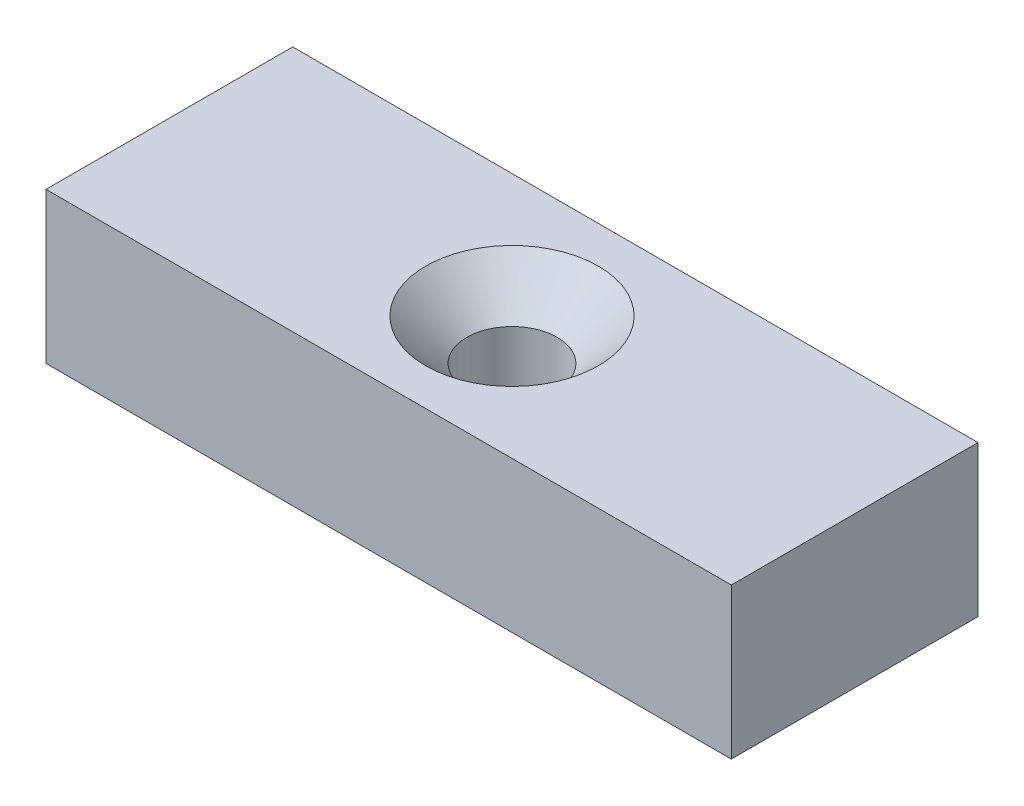
ISO-10303-21;
HEADER;
FILE_DESCRIPTION(('STEP AP214'),'2;1');
FILE_NAME('part.step','',(''),(''),'','','');
FILE_SCHEMA(('AUTOMOTIVE_DESIGN { 1 0 10303 214 1 1 1 1 }'));
ENDSEC;
DATA;
#1=APPLICATION_CONTEXT('core data for automotive mechanical design processes');
#2=APPLICATION_PROTOCOL_DEFINITION('international standard','automotive_design',2000,#1);
#3=PRODUCT_CONTEXT('',#1,'mechanical');
#4=PRODUCT('Part','Part','',(#3));
#5=PRODUCT_RELATED_PRODUCT_CATEGORY('part','',(#4));
#6=PRODUCT_DEFINITION_FORMATION('','',#4);
#7=PRODUCT_DEFINITION_CONTEXT('part definition',#1,'design');
#8=PRODUCT_DEFINITION('design','',#6,#7);
#9=PRODUCT_DEFINITION_SHAPE('','',#8);
#10=(LENGTH_UNIT() NAMED_UNIT(*) SI_UNIT(.MILLI.,.METRE.));
#11=(NAMED_UNIT(*) PLANE_ANGLE_UNIT() SI_UNIT($,.RADIAN.));
#12=(NAMED_UNIT(*) SI_UNIT($,.STERADIAN.) SOLID_ANGLE_UNIT());
#13=UNCERTAINTY_MEASURE_WITH_UNIT(LENGTH_MEASURE(1.E-05),#10,'distance_accuracy_value','');
#14=(GEOMETRIC_REPRESENTATION_CONTEXT(3) GLOBAL_UNCERTAINTY_ASSIGNED_CONTEXT((#13)) GLOBAL_UNIT_ASSIGNED_CONTEXT((#10,
#11,#12)) REPRESENTATION_CONTEXT('',''));
#15=CARTESIAN_POINT('',(0.,0.,0.));
#16=DIRECTION('',(0.,0.,1.));
#17=DIRECTION('',(1.,0.,0.));
#18=AXIS2_PLACEMENT_3D('',#15,#16,#17);
#19=CARTESIAN_POINT('',(0.,11.,9.));
#20=DIRECTION('',(0.,0.,-1.));
#21=DIRECTION('',(-1.,0.,0.));
#22=AXIS2_PLACEMENT_3D('',#19,#20,#21);
#23=PLANE('',#22);
#24=DIRECTION('',(1.,0.,0.));
#25=VECTOR('',#24,1.);
#26=CARTESIAN_POINT('',(0.,0.,9.));
#27=LINE('',#26,#25);
#28=CARTESIAN_POINT('',(0.,0.,9.));
#29=VERTEX_POINT('',#28);
#30=CARTESIAN_POINT('',(50.,0.,9.));
#31=VERTEX_POINT('',#30);
#32=EDGE_CURVE('E98',#29,#31,#27,.T.);
#33=ORIENTED_EDGE('',*,*,#32,.T.);
#34=DIRECTION('',(0.,-1.,0.));
#35=VECTOR('',#34,1.);
#36=CARTESIAN_POINT('',(50.,11.,9.));
#37=LINE('',#36,#35);
#38=CARTESIAN_POINT('',(50.,11.,9.));
#39=VERTEX_POINT('',#38);
#40=EDGE_CURVE('E41',#39,#31,#37,.T.);
#41=ORIENTED_EDGE('',*,*,#40,.F.);
#42=DIRECTION('',(1.,0.,0.));
#43=VECTOR('',#42,1.);
#44=CARTESIAN_POINT('',(0.,11.,9.));
#45=LINE('',#44,#43);
#46=CARTESIAN_POINT('',(0.,11.,9.));
#47=VERTEX_POINT('',#46);
#48=EDGE_CURVE('E87',#47,#39,#45,.T.);
#49=ORIENTED_EDGE('',*,*,#48,.F.);
#50=DIRECTION('',(0.,-1.,0.));
#51=VECTOR('',#50,1.);
#52=CARTESIAN_POINT('',(0.,11.,9.));
#53=LINE('',#52,#51);
#54=EDGE_CURVE('E11',#47,#29,#53,.T.);
#55=ORIENTED_EDGE('',*,*,#54,.T.);
#56=EDGE_LOOP('',(#33,#41,#49,#55));
#57=FACE_BOUND('',#56,.T.);
#58=ADVANCED_FACE('F34',(#57),#23,.F.);
#59=CARTESIAN_POINT('',(0.,11.,-9.));
#60=DIRECTION('',(0.,0.,1.));
#61=DIRECTION('',(1.,0.,0.));
#62=AXIS2_PLACEMENT_3D('',#59,#60,#61);
#63=PLANE('',#62);
#64=DIRECTION('',(-1.,0.,0.));
#65=VECTOR('',#64,1.);
#66=CARTESIAN_POINT('',(0.,0.,-9.));
#67=LINE('',#66,#65);
#68=CARTESIAN_POINT('',(50.,0.,-9.));
#69=VERTEX_POINT('',#68);
#70=CARTESIAN_POINT('',(0.,0.,-9.));
#71=VERTEX_POINT('',#70);
#72=EDGE_CURVE('E92',#69,#71,#67,.T.);
#73=ORIENTED_EDGE('',*,*,#72,.T.);
#74=DIRECTION('',(0.,-1.,0.));
#75=VECTOR('',#74,1.);
#76=CARTESIAN_POINT('',(0.,11.,-9.));
#77=LINE('',#76,#75);
#78=CARTESIAN_POINT('',(0.,11.,-9.));
#79=VERTEX_POINT('',#78);
#80=EDGE_CURVE('E48',#79,#71,#77,.T.);
#81=ORIENTED_EDGE('',*,*,#80,.F.);
#82=DIRECTION('',(-1.,0.,0.));
#83=VECTOR('',#82,1.);
#84=CARTESIAN_POINT('',(0.,11.,-9.));
#85=LINE('',#84,#83);
#86=CARTESIAN_POINT('',(50.,11.,-9.));
#87=VERTEX_POINT('',#86);
#88=EDGE_CURVE('E82',#87,#79,#85,.T.);
#89=ORIENTED_EDGE('',*,*,#88,.F.);
#90=DIRECTION('',(0.,-1.,0.));
#91=VECTOR('',#90,1.);
#92=CARTESIAN_POINT('',(50.,11.,-9.));
#93=LINE('',#92,#91);
#94=EDGE_CURVE('E93',#87,#69,#93,.T.);
#95=ORIENTED_EDGE('',*,*,#94,.T.);
#96=EDGE_LOOP('',(#73,#81,#89,#95));
#97=FACE_BOUND('',#96,.T.);
#98=ADVANCED_FACE('F90',(#97),#63,.F.);
#99=CARTESIAN_POINT('',(0.,11.,0.));
#100=DIRECTION('',(0.,1.,0.));
#101=DIRECTION('',(0.,0.,1.));
#102=AXIS2_PLACEMENT_3D('',#99,#100,#101);
#103=PLANE('',#102);
#104=CARTESIAN_POINT('',(25.,11.,0.));
#105=DIRECTION('',(0.,1.,0.));
#106=DIRECTION('',(0.,0.,1.));
#107=AXIS2_PLACEMENT_3D('',#104,#105,#106);
#108=CIRCLE('',#107,6.3);
#109=CARTESIAN_POINT('',(25.,11.,6.3));
#110=VERTEX_POINT('',#109);
#111=EDGE_CURVE('E111',#110,#110,#108,.T.);
#112=ORIENTED_EDGE('',*,*,#111,.F.);
#113=EDGE_LOOP('',(#112));
#114=FACE_BOUND('',#113,.T.);
#115=DIRECTION('',(0.,0.,-1.));
#116=VECTOR('',#115,1.);
#117=CARTESIAN_POINT('',(0.,11.,-9.));
#118=LINE('',#117,#116);
#119=EDGE_CURVE('E71',#47,#79,#118,.T.);
#120=ORIENTED_EDGE('',*,*,#119,.F.);
#121=ORIENTED_EDGE('',*,*,#48,.T.);
#122=DIRECTION('',(0.,0.,1.));
#123=VECTOR('',#122,1.);
#124=CARTESIAN_POINT('',(50.,11.,-9.));
#125=LINE('',#124,#123);
#126=EDGE_CURVE('E84',#87,#39,#125,.T.);
#127=ORIENTED_EDGE('',*,*,#126,.F.);
#128=ORIENTED_EDGE('',*,*,#88,.T.);
#129=EDGE_LOOP('',(#120,#121,#127,#128));
#130=FACE_BOUND('',#129,.T.);
#131=ADVANCED_FACE('F83',(#114,#130),#103,.T.);
#132=CARTESIAN_POINT('',(0.,0.,0.));
#133=DIRECTION('',(0.,1.,0.));
#134=DIRECTION('',(0.,0.,1.));
#135=AXIS2_PLACEMENT_3D('',#132,#133,#134);
#136=PLANE('',#135);
#137=CARTESIAN_POINT('',(25.,0.,0.));
#138=DIRECTION('',(0.,1.,0.));
#139=DIRECTION('',(0.,0.,1.));
#140=AXIS2_PLACEMENT_3D('',#137,#138,#139);
#141=CIRCLE('',#140,3.3);
#142=CARTESIAN_POINT('',(25.,0.,3.3));
#143=VERTEX_POINT('',#142);
#144=EDGE_CURVE('E103',#143,#143,#141,.T.);
#145=ORIENTED_EDGE('',*,*,#144,.T.);
#146=EDGE_LOOP('',(#145));
#147=FACE_BOUND('',#146,.T.);
#148=ORIENTED_EDGE('',*,*,#32,.F.);
#149=DIRECTION('',(0.,0.,-1.));
#150=VECTOR('',#149,1.);
#151=CARTESIAN_POINT('',(0.,0.,-9.));
#152=LINE('',#151,#150);
#153=EDGE_CURVE('E77',#29,#71,#152,.T.);
#154=ORIENTED_EDGE('',*,*,#153,.T.);
#155=ORIENTED_EDGE('',*,*,#72,.F.);
#156=DIRECTION('',(0.,0.,1.));
#157=VECTOR('',#156,1.);
#158=CARTESIAN_POINT('',(50.,0.,-9.));
#159=LINE('',#158,#157);
#160=EDGE_CURVE('E78',#69,#31,#159,.T.);
#161=ORIENTED_EDGE('',*,*,#160,.T.);
#162=EDGE_LOOP('',(#148,#154,#155,#161));
#163=FACE_BOUND('',#162,.T.);
#164=ADVANCED_FACE('F118',(#147,#163),#136,.F.);
#165=CARTESIAN_POINT('',(50.,0.,-9.));
#166=DIRECTION('',(-1.,0.,0.));
#167=DIRECTION('',(0.,0.,1.));
#168=AXIS2_PLACEMENT_3D('',#165,#166,#167);
#169=PLANE('',#168);
#170=ORIENTED_EDGE('',*,*,#126,.T.);
#171=ORIENTED_EDGE('',*,*,#40,.T.);
#172=ORIENTED_EDGE('',*,*,#160,.F.);
#173=ORIENTED_EDGE('',*,*,#94,.F.);
#174=EDGE_LOOP('',(#170,#171,#172,#173));
#175=FACE_BOUND('',#174,.T.);
#176=ADVANCED_FACE('F124',(#175),#169,.F.);
#177=CARTESIAN_POINT('',(0.,0.,-9.));
#178=DIRECTION('',(1.,0.,0.));
#179=DIRECTION('',(0.,0.,-1.));
#180=AXIS2_PLACEMENT_3D('',#177,#178,#179);
#181=PLANE('',#180);
#182=ORIENTED_EDGE('',*,*,#119,.T.);
#183=ORIENTED_EDGE('',*,*,#80,.T.);
#184=ORIENTED_EDGE('',*,*,#153,.F.);
#185=ORIENTED_EDGE('',*,*,#54,.F.);
#186=EDGE_LOOP('',(#182,#183,#184,#185));
#187=FACE_BOUND('',#186,.T.);
#188=ADVANCED_FACE('F73',(#187),#181,.F.);
#189=CARTESIAN_POINT('',(25.,11.,0.));
#190=DIRECTION('',(0.,1.,0.));
#191=DIRECTION('',(0.,0.,1.));
#192=AXIS2_PLACEMENT_3D('',#189,#190,#191);
#193=CYLINDRICAL_SURFACE('',#192,3.3);
#194=ORIENTED_EDGE('',*,*,#144,.F.);
#195=EDGE_LOOP('',(#194));
#196=FACE_BOUND('',#195,.T.);
#197=CARTESIAN_POINT('',(25.,8.,0.));
#198=DIRECTION('',(0.,1.,0.));
#199=DIRECTION('',(0.,0.,1.));
#200=AXIS2_PLACEMENT_3D('',#197,#198,#199);
#201=CIRCLE('',#200,3.3);
#202=CARTESIAN_POINT('',(25.,8.,3.3));
#203=VERTEX_POINT('',#202);
#204=EDGE_CURVE('E108',#203,#203,#201,.T.);
#205=ORIENTED_EDGE('',*,*,#204,.T.);
#206=EDGE_LOOP('',(#205));
#207=FACE_BOUND('',#206,.T.);
#208=ADVANCED_FACE('F138',(#196,#207),#193,.F.);
#209=CARTESIAN_POINT('',(25.,11.,0.));
#210=DIRECTION('',(0.,1.,0.));
#211=DIRECTION('',(0.,0.,1.));
#212=AXIS2_PLACEMENT_3D('',#209,#210,#211);
#213=CONICAL_SURFACE('',#212,6.3,0.785398163397449);
#214=ORIENTED_EDGE('',*,*,#204,.F.);
#215=EDGE_LOOP('',(#214));
#216=FACE_BOUND('',#215,.T.);
#217=ORIENTED_EDGE('',*,*,#111,.T.);
#218=EDGE_LOOP('',(#217));
#219=FACE_BOUND('',#218,.T.);
#220=ADVANCED_FACE('F115',(#216,#219),#213,.F.);
#221=CLOSED_SHELL('',(#58,#98,#131,#164,#176,#188,#208,#220));
#222=MANIFOLD_SOLID_BREP('B2',#221);
#223=ADVANCED_BREP_SHAPE_REPRESENTATION('',(#18,#222),#14);
#224=SHAPE_DEFINITION_REPRESENTATION(#9,#223);
ENDSEC;
END-ISO-10303-21;
